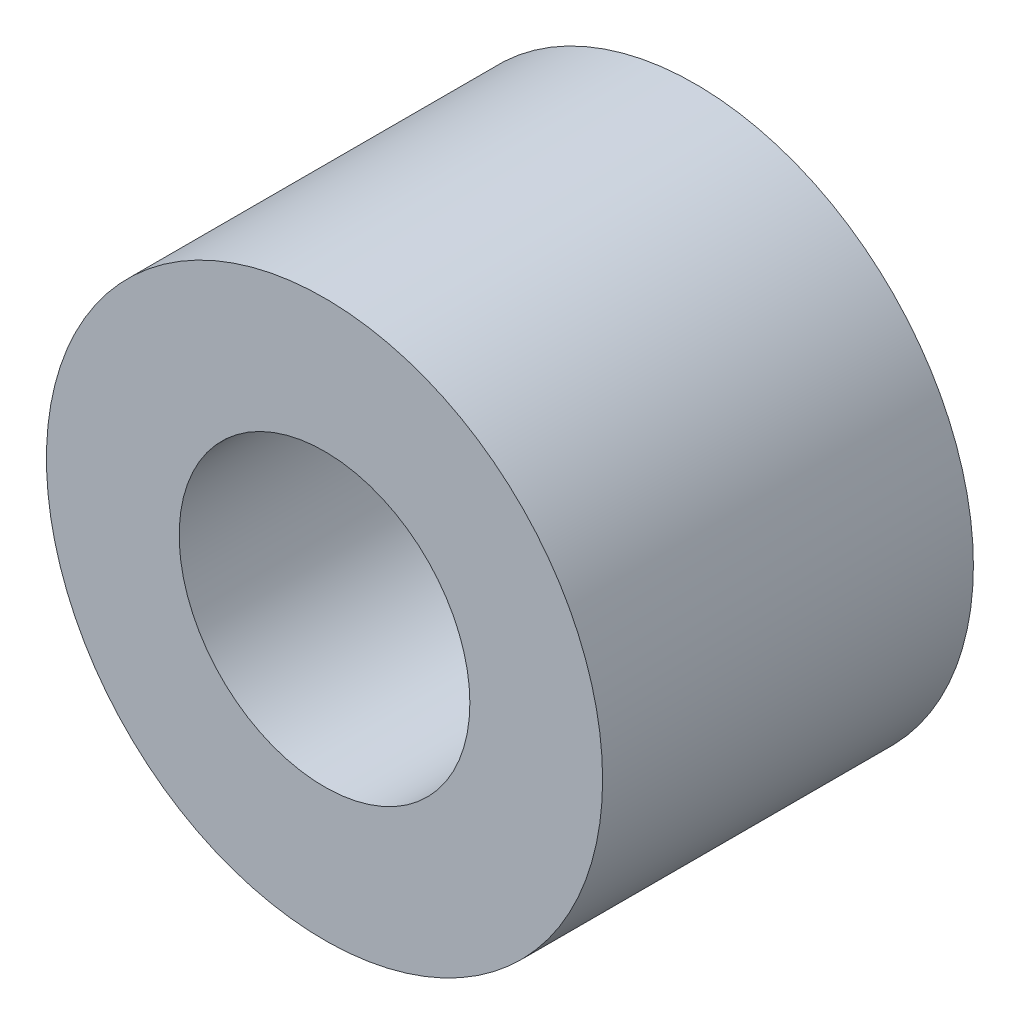
ISO-10303-21;
HEADER;
FILE_DESCRIPTION(('STEP AP214'),'2;1');
FILE_NAME('part.step','',(''),(''),'','','');
FILE_SCHEMA(('AUTOMOTIVE_DESIGN { 1 0 10303 214 1 1 1 1 }'));
ENDSEC;
DATA;
#1=APPLICATION_CONTEXT('core data for automotive mechanical design processes');
#2=APPLICATION_PROTOCOL_DEFINITION('international standard','automotive_design',2000,#1);
#3=PRODUCT_CONTEXT('',#1,'mechanical');
#4=PRODUCT('Part','Part','',(#3));
#5=PRODUCT_RELATED_PRODUCT_CATEGORY('part','',(#4));
#6=PRODUCT_DEFINITION_FORMATION('','',#4);
#7=PRODUCT_DEFINITION_CONTEXT('part definition',#1,'design');
#8=PRODUCT_DEFINITION('design','',#6,#7);
#9=PRODUCT_DEFINITION_SHAPE('','',#8);
#10=(LENGTH_UNIT() NAMED_UNIT(*) SI_UNIT(.MILLI.,.METRE.));
#11=(NAMED_UNIT(*) PLANE_ANGLE_UNIT() SI_UNIT($,.RADIAN.));
#12=(NAMED_UNIT(*) SI_UNIT($,.STERADIAN.) SOLID_ANGLE_UNIT());
#13=UNCERTAINTY_MEASURE_WITH_UNIT(LENGTH_MEASURE(1.E-05),#10,'distance_accuracy_value','');
#14=(GEOMETRIC_REPRESENTATION_CONTEXT(3) GLOBAL_UNCERTAINTY_ASSIGNED_CONTEXT((#13)) GLOBAL_UNIT_ASSIGNED_CONTEXT((#10,
#11,#12)) REPRESENTATION_CONTEXT('',''));
#15=CARTESIAN_POINT('',(0.,0.,0.));
#16=DIRECTION('',(0.,0.,1.));
#17=DIRECTION('',(1.,0.,0.));
#18=AXIS2_PLACEMENT_3D('',#15,#16,#17);
#19=CARTESIAN_POINT('',(0.,0.,3.175));
#20=DIRECTION('',(0.,0.,1.));
#21=DIRECTION('',(1.,0.,0.));
#22=AXIS2_PLACEMENT_3D('',#19,#20,#21);
#23=PLANE('',#22);
#24=CARTESIAN_POINT('',(0.,0.,3.175));
#25=DIRECTION('',(0.,0.,1.));
#26=DIRECTION('',(1.,0.,0.));
#27=AXIS2_PLACEMENT_3D('',#24,#25,#26);
#28=CIRCLE('',#27,4.7625);
#29=CARTESIAN_POINT('',(4.7625,0.,3.175));
#30=VERTEX_POINT('',#29);
#31=EDGE_CURVE('E10',#30,#30,#28,.T.);
#32=ORIENTED_EDGE('',*,*,#31,.T.);
#33=EDGE_LOOP('',(#32));
#34=FACE_BOUND('',#33,.T.);
#35=CARTESIAN_POINT('',(0.,0.,3.175));
#36=DIRECTION('',(0.,0.,1.));
#37=DIRECTION('',(1.,0.,0.));
#38=AXIS2_PLACEMENT_3D('',#35,#36,#37);
#39=CIRCLE('',#38,2.4892);
#40=CARTESIAN_POINT('',(2.4892,0.,3.175));
#41=VERTEX_POINT('',#40);
#42=EDGE_CURVE('E50',#41,#41,#39,.T.);
#43=ORIENTED_EDGE('',*,*,#42,.F.);
#44=EDGE_LOOP('',(#43));
#45=FACE_BOUND('',#44,.T.);
#46=ADVANCED_FACE('F37',(#34,#45),#23,.T.);
#47=CARTESIAN_POINT('',(0.,0.,-3.175));
#48=DIRECTION('',(0.,0.,1.));
#49=DIRECTION('',(1.,0.,0.));
#50=AXIS2_PLACEMENT_3D('',#47,#48,#49);
#51=PLANE('',#50);
#52=CARTESIAN_POINT('',(0.,0.,-3.175));
#53=DIRECTION('',(0.,0.,1.));
#54=DIRECTION('',(1.,0.,0.));
#55=AXIS2_PLACEMENT_3D('',#52,#53,#54);
#56=CIRCLE('',#55,4.7625);
#57=CARTESIAN_POINT('',(4.7625,0.,-3.175));
#58=VERTEX_POINT('',#57);
#59=EDGE_CURVE('E41',#58,#58,#56,.T.);
#60=ORIENTED_EDGE('',*,*,#59,.F.);
#61=EDGE_LOOP('',(#60));
#62=FACE_BOUND('',#61,.T.);
#63=CARTESIAN_POINT('',(0.,0.,-3.175));
#64=DIRECTION('',(0.,0.,1.));
#65=DIRECTION('',(1.,0.,0.));
#66=AXIS2_PLACEMENT_3D('',#63,#64,#65);
#67=CIRCLE('',#66,2.4892);
#68=CARTESIAN_POINT('',(2.4892,0.,-3.175));
#69=VERTEX_POINT('',#68);
#70=EDGE_CURVE('E52',#69,#69,#67,.T.);
#71=ORIENTED_EDGE('',*,*,#70,.T.);
#72=EDGE_LOOP('',(#71));
#73=FACE_BOUND('',#72,.T.);
#74=ADVANCED_FACE('F64',(#62,#73),#51,.F.);
#75=CARTESIAN_POINT('',(0.,0.,3.175));
#76=DIRECTION('',(0.,0.,-1.));
#77=DIRECTION('',(-1.,0.,0.));
#78=AXIS2_PLACEMENT_3D('',#75,#76,#77);
#79=CYLINDRICAL_SURFACE('',#78,4.7625);
#80=ORIENTED_EDGE('',*,*,#31,.F.);
#81=EDGE_LOOP('',(#80));
#82=FACE_BOUND('',#81,.T.);
#83=ORIENTED_EDGE('',*,*,#59,.T.);
#84=EDGE_LOOP('',(#83));
#85=FACE_BOUND('',#84,.T.);
#86=ADVANCED_FACE('F39',(#82,#85),#79,.T.);
#87=CARTESIAN_POINT('',(0.,0.,3.175));
#88=DIRECTION('',(0.,0.,-1.));
#89=DIRECTION('',(-1.,0.,0.));
#90=AXIS2_PLACEMENT_3D('',#87,#88,#89);
#91=CYLINDRICAL_SURFACE('',#90,2.4892);
#92=ORIENTED_EDGE('',*,*,#42,.T.);
#93=EDGE_LOOP('',(#92));
#94=FACE_BOUND('',#93,.T.);
#95=ORIENTED_EDGE('',*,*,#70,.F.);
#96=EDGE_LOOP('',(#95));
#97=FACE_BOUND('',#96,.T.);
#98=ADVANCED_FACE('F60',(#94,#97),#91,.F.);
#99=CLOSED_SHELL('',(#46,#74,#86,#98));
#100=MANIFOLD_SOLID_BREP('B2',#99);
#101=ADVANCED_BREP_SHAPE_REPRESENTATION('',(#18,#100),#14);
#102=SHAPE_DEFINITION_REPRESENTATION(#9,#101);
ENDSEC;
END-ISO-10303-21;
